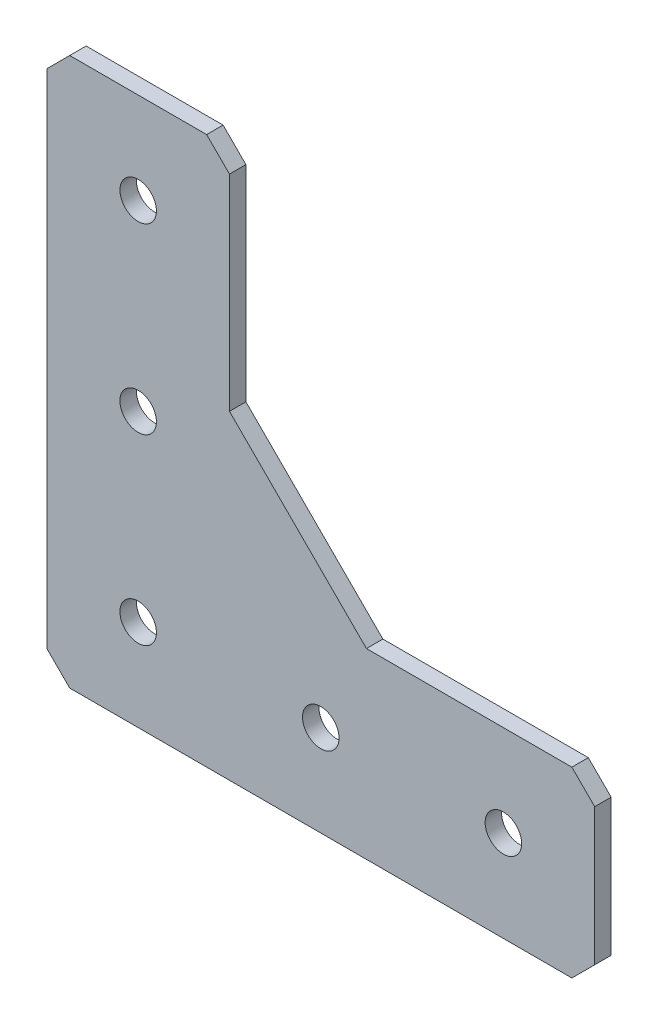
ISO-10303-21;
HEADER;
FILE_DESCRIPTION(('STEP AP214'),'2;1');
FILE_NAME('part.step','',(''),(''),'','','');
FILE_SCHEMA(('AUTOMOTIVE_DESIGN { 1 0 10303 214 1 1 1 1 }'));
ENDSEC;
DATA;
#1=APPLICATION_CONTEXT('core data for automotive mechanical design processes');
#2=APPLICATION_PROTOCOL_DEFINITION('international standard','automotive_design',2000,#1);
#3=PRODUCT_CONTEXT('',#1,'mechanical');
#4=PRODUCT('Part','Part','',(#3));
#5=PRODUCT_RELATED_PRODUCT_CATEGORY('part','',(#4));
#6=PRODUCT_DEFINITION_FORMATION('','',#4);
#7=PRODUCT_DEFINITION_CONTEXT('part definition',#1,'design');
#8=PRODUCT_DEFINITION('design','',#6,#7);
#9=PRODUCT_DEFINITION_SHAPE('','',#8);
#10=(LENGTH_UNIT() NAMED_UNIT(*) SI_UNIT(.MILLI.,.METRE.));
#11=(NAMED_UNIT(*) PLANE_ANGLE_UNIT() SI_UNIT($,.RADIAN.));
#12=(NAMED_UNIT(*) SI_UNIT($,.STERADIAN.) SOLID_ANGLE_UNIT());
#13=UNCERTAINTY_MEASURE_WITH_UNIT(LENGTH_MEASURE(1.E-05),#10,'distance_accuracy_value','');
#14=(GEOMETRIC_REPRESENTATION_CONTEXT(3) GLOBAL_UNCERTAINTY_ASSIGNED_CONTEXT((#13)) GLOBAL_UNIT_ASSIGNED_CONTEXT((#10,
#11,#12)) REPRESENTATION_CONTEXT('',''));
#15=CARTESIAN_POINT('',(0.,0.,0.));
#16=DIRECTION('',(0.,0.,1.));
#17=DIRECTION('',(1.,0.,0.));
#18=AXIS2_PLACEMENT_3D('',#15,#16,#17);
#19=CARTESIAN_POINT('',(0.,0.,0.));
#20=DIRECTION('',(0.,0.,-1.));
#21=DIRECTION('',(-1.,0.,0.));
#22=AXIS2_PLACEMENT_3D('',#19,#20,#21);
#23=PLANE('',#22);
#24=DIRECTION('',(-0.707106781186548,0.707106781186548,0.));
#25=VECTOR('',#24,1.);
#26=CARTESIAN_POINT('',(73.025,25.4,0.));
#27=LINE('',#26,#25);
#28=CARTESIAN_POINT('',(76.2,22.225,0.));
#29=VERTEX_POINT('',#28);
#30=CARTESIAN_POINT('',(73.0249999999999,25.4,0.));
#31=VERTEX_POINT('',#30);
#32=EDGE_CURVE('E402',#29,#31,#27,.T.);
#33=ORIENTED_EDGE('',*,*,#32,.F.);
#34=DIRECTION('',(0.,1.,0.));
#35=VECTOR('',#34,1.);
#36=CARTESIAN_POINT('',(76.2,22.225,0.));
#37=LINE('',#36,#35);
#38=CARTESIAN_POINT('',(76.2,3.175,0.));
#39=VERTEX_POINT('',#38);
#40=EDGE_CURVE('E398',#39,#29,#37,.T.);
#41=ORIENTED_EDGE('',*,*,#40,.F.);
#42=DIRECTION('',(0.707106781186549,0.707106781186546,0.));
#43=VECTOR('',#42,1.);
#44=CARTESIAN_POINT('',(76.2,3.175,0.));
#45=LINE('',#44,#43);
#46=CARTESIAN_POINT('',(73.025,0.,0.));
#47=VERTEX_POINT('',#46);
#48=EDGE_CURVE('E123',#47,#39,#45,.T.);
#49=ORIENTED_EDGE('',*,*,#48,.F.);
#50=DIRECTION('',(1.,0.,0.));
#51=VECTOR('',#50,1.);
#52=CARTESIAN_POINT('',(73.025,0.,0.));
#53=LINE('',#52,#51);
#54=CARTESIAN_POINT('',(3.175,0.,0.));
#55=VERTEX_POINT('',#54);
#56=EDGE_CURVE('E117',#55,#47,#53,.T.);
#57=ORIENTED_EDGE('',*,*,#56,.F.);
#58=DIRECTION('',(0.707106781186546,-0.707106781186549,0.));
#59=VECTOR('',#58,1.);
#60=CARTESIAN_POINT('',(3.175,0.,0.));
#61=LINE('',#60,#59);
#62=CARTESIAN_POINT('',(0.,3.17500000000001,0.));
#63=VERTEX_POINT('',#62);
#64=EDGE_CURVE('E108',#63,#55,#61,.T.);
#65=ORIENTED_EDGE('',*,*,#64,.F.);
#66=DIRECTION('',(0.,-1.,0.));
#67=VECTOR('',#66,1.);
#68=CARTESIAN_POINT('',(0.,3.17500000000001,0.));
#69=LINE('',#68,#67);
#70=CARTESIAN_POINT('',(0.,73.025,0.));
#71=VERTEX_POINT('',#70);
#72=EDGE_CURVE('E103',#71,#63,#69,.T.);
#73=ORIENTED_EDGE('',*,*,#72,.F.);
#74=DIRECTION('',(-0.707106781186551,-0.707106781186544,0.));
#75=VECTOR('',#74,1.);
#76=CARTESIAN_POINT('',(0.,73.025,0.));
#77=LINE('',#76,#75);
#78=CARTESIAN_POINT('',(3.17500000000003,76.2,0.));
#79=VERTEX_POINT('',#78);
#80=EDGE_CURVE('E425',#79,#71,#77,.T.);
#81=ORIENTED_EDGE('',*,*,#80,.F.);
#82=DIRECTION('',(1.,0.,0.));
#83=VECTOR('',#82,1.);
#84=CARTESIAN_POINT('',(3.17500000000003,76.2,0.));
#85=LINE('',#84,#83);
#86=CARTESIAN_POINT('',(22.225,76.2,0.));
#87=VERTEX_POINT('',#86);
#88=EDGE_CURVE('E422',#87,#79,#85,.F.);
#89=ORIENTED_EDGE('',*,*,#88,.F.);
#90=DIRECTION('',(-0.707106781186546,0.707106781186549,0.));
#91=VECTOR('',#90,1.);
#92=CARTESIAN_POINT('',(22.225,76.2,0.));
#93=LINE('',#92,#91);
#94=CARTESIAN_POINT('',(25.4,73.025,0.));
#95=VERTEX_POINT('',#94);
#96=EDGE_CURVE('E418',#95,#87,#93,.T.);
#97=ORIENTED_EDGE('',*,*,#96,.F.);
#98=DIRECTION('',(0.,1.,0.));
#99=VECTOR('',#98,1.);
#100=CARTESIAN_POINT('',(25.4,73.025,0.));
#101=LINE('',#100,#99);
#102=CARTESIAN_POINT('',(25.4,44.4500000000001,0.));
#103=VERTEX_POINT('',#102);
#104=EDGE_CURVE('E414',#103,#95,#101,.T.);
#105=ORIENTED_EDGE('',*,*,#104,.F.);
#106=DIRECTION('',(-0.707106781186544,0.707106781186551,0.));
#107=VECTOR('',#106,1.);
#108=CARTESIAN_POINT('',(25.4,44.4500000000001,0.));
#109=LINE('',#108,#107);
#110=CARTESIAN_POINT('',(44.45,25.4,0.));
#111=VERTEX_POINT('',#110);
#112=EDGE_CURVE('E410',#111,#103,#109,.T.);
#113=ORIENTED_EDGE('',*,*,#112,.F.);
#114=DIRECTION('',(-1.,0.,0.));
#115=VECTOR('',#114,1.);
#116=CARTESIAN_POINT('',(44.45,25.4,0.));
#117=LINE('',#116,#115);
#118=EDGE_CURVE('E406',#31,#111,#117,.T.);
#119=ORIENTED_EDGE('',*,*,#118,.F.);
#120=EDGE_LOOP('',(#33,#41,#49,#57,#65,#73,#81,#89,#97,#105,#113,#119));
#121=FACE_BOUND('',#120,.T.);
#122=CARTESIAN_POINT('',(12.7,12.7,0.));
#123=DIRECTION('',(0.,0.,-1.));
#124=DIRECTION('',(-1.,0.,0.));
#125=AXIS2_PLACEMENT_3D('',#122,#123,#124);
#126=CIRCLE('',#125,2.53999999999999);
#127=CARTESIAN_POINT('',(10.16,12.7,0.));
#128=VERTEX_POINT('',#127);
#129=EDGE_CURVE('E127',#128,#128,#126,.F.);
#130=ORIENTED_EDGE('',*,*,#129,.T.);
#131=EDGE_LOOP('',(#130));
#132=FACE_BOUND('',#131,.T.);
#133=CARTESIAN_POINT('',(12.7,63.5,0.));
#134=DIRECTION('',(0.,0.,-1.));
#135=DIRECTION('',(-1.,0.,0.));
#136=AXIS2_PLACEMENT_3D('',#133,#134,#135);
#137=CIRCLE('',#136,2.53999999999999);
#138=CARTESIAN_POINT('',(10.16,63.5,0.));
#139=VERTEX_POINT('',#138);
#140=EDGE_CURVE('E154',#139,#139,#137,.F.);
#141=ORIENTED_EDGE('',*,*,#140,.T.);
#142=EDGE_LOOP('',(#141));
#143=FACE_BOUND('',#142,.T.);
#144=CARTESIAN_POINT('',(12.7,38.1,0.));
#145=DIRECTION('',(0.,0.,-1.));
#146=DIRECTION('',(-1.,0.,0.));
#147=AXIS2_PLACEMENT_3D('',#144,#145,#146);
#148=CIRCLE('',#147,2.53999999999999);
#149=CARTESIAN_POINT('',(10.16,38.1,0.));
#150=VERTEX_POINT('',#149);
#151=EDGE_CURVE('E157',#150,#150,#148,.F.);
#152=ORIENTED_EDGE('',*,*,#151,.T.);
#153=EDGE_LOOP('',(#152));
#154=FACE_BOUND('',#153,.T.);
#155=CARTESIAN_POINT('',(63.5,12.7,0.));
#156=DIRECTION('',(0.,0.,-1.));
#157=DIRECTION('',(-1.,0.,0.));
#158=AXIS2_PLACEMENT_3D('',#155,#156,#157);
#159=CIRCLE('',#158,2.54);
#160=CARTESIAN_POINT('',(60.96,12.7,0.));
#161=VERTEX_POINT('',#160);
#162=EDGE_CURVE('E159',#161,#161,#159,.F.);
#163=ORIENTED_EDGE('',*,*,#162,.T.);
#164=EDGE_LOOP('',(#163));
#165=FACE_BOUND('',#164,.T.);
#166=CARTESIAN_POINT('',(38.1,12.7,0.));
#167=DIRECTION('',(0.,0.,-1.));
#168=DIRECTION('',(-1.,0.,0.));
#169=AXIS2_PLACEMENT_3D('',#166,#167,#168);
#170=CIRCLE('',#169,2.53999999999999);
#171=CARTESIAN_POINT('',(35.56,12.7,0.));
#172=VERTEX_POINT('',#171);
#173=EDGE_CURVE('E21',#172,#172,#170,.F.);
#174=ORIENTED_EDGE('',*,*,#173,.T.);
#175=EDGE_LOOP('',(#174));
#176=FACE_BOUND('',#175,.T.);
#177=ADVANCED_FACE('F18',(#121,#132,#143,#154,#165,#176),#23,.T.);
#178=CARTESIAN_POINT('',(38.1,12.7,2.286));
#179=DIRECTION('',(0.,0.,-1.));
#180=DIRECTION('',(-1.,0.,0.));
#181=AXIS2_PLACEMENT_3D('',#178,#179,#180);
#182=CYLINDRICAL_SURFACE('',#181,2.53999999999999);
#183=CARTESIAN_POINT('',(38.1,12.7,2.286));
#184=DIRECTION('',(0.,0.,-1.));
#185=DIRECTION('',(-1.,0.,0.));
#186=AXIS2_PLACEMENT_3D('',#183,#184,#185);
#187=CIRCLE('',#186,2.53999999999999);
#188=CARTESIAN_POINT('',(35.56,12.7,2.286));
#189=VERTEX_POINT('',#188);
#190=EDGE_CURVE('E148',#189,#189,#187,.F.);
#191=ORIENTED_EDGE('',*,*,#190,.T.);
#192=EDGE_LOOP('',(#191));
#193=FACE_BOUND('',#192,.T.);
#194=ORIENTED_EDGE('',*,*,#173,.F.);
#195=EDGE_LOOP('',(#194));
#196=FACE_BOUND('',#195,.T.);
#197=ADVANCED_FACE('F167',(#193,#196),#182,.F.);
#198=CARTESIAN_POINT('',(63.5,12.7,2.286));
#199=DIRECTION('',(0.,0.,-1.));
#200=DIRECTION('',(-1.,0.,0.));
#201=AXIS2_PLACEMENT_3D('',#198,#199,#200);
#202=CYLINDRICAL_SURFACE('',#201,2.54);
#203=CARTESIAN_POINT('',(63.5,12.7,2.286));
#204=DIRECTION('',(0.,0.,-1.));
#205=DIRECTION('',(-1.,0.,0.));
#206=AXIS2_PLACEMENT_3D('',#203,#204,#205);
#207=CIRCLE('',#206,2.54);
#208=CARTESIAN_POINT('',(60.96,12.7,2.286));
#209=VERTEX_POINT('',#208);
#210=EDGE_CURVE('E145',#209,#209,#207,.F.);
#211=ORIENTED_EDGE('',*,*,#210,.T.);
#212=EDGE_LOOP('',(#211));
#213=FACE_BOUND('',#212,.T.);
#214=ORIENTED_EDGE('',*,*,#162,.F.);
#215=EDGE_LOOP('',(#214));
#216=FACE_BOUND('',#215,.T.);
#217=ADVANCED_FACE('F169',(#213,#216),#202,.F.);
#218=CARTESIAN_POINT('',(12.7,38.1,2.286));
#219=DIRECTION('',(0.,0.,-1.));
#220=DIRECTION('',(-1.,0.,0.));
#221=AXIS2_PLACEMENT_3D('',#218,#219,#220);
#222=CYLINDRICAL_SURFACE('',#221,2.53999999999999);
#223=CARTESIAN_POINT('',(12.7,38.1,2.286));
#224=DIRECTION('',(0.,0.,-1.));
#225=DIRECTION('',(-1.,0.,0.));
#226=AXIS2_PLACEMENT_3D('',#223,#224,#225);
#227=CIRCLE('',#226,2.53999999999999);
#228=CARTESIAN_POINT('',(10.16,38.1,2.286));
#229=VERTEX_POINT('',#228);
#230=EDGE_CURVE('E142',#229,#229,#227,.F.);
#231=ORIENTED_EDGE('',*,*,#230,.T.);
#232=EDGE_LOOP('',(#231));
#233=FACE_BOUND('',#232,.T.);
#234=ORIENTED_EDGE('',*,*,#151,.F.);
#235=EDGE_LOOP('',(#234));
#236=FACE_BOUND('',#235,.T.);
#237=ADVANCED_FACE('F176',(#233,#236),#222,.F.);
#238=CARTESIAN_POINT('',(12.7,63.5,2.286));
#239=DIRECTION('',(0.,0.,-1.));
#240=DIRECTION('',(-1.,0.,0.));
#241=AXIS2_PLACEMENT_3D('',#238,#239,#240);
#242=CYLINDRICAL_SURFACE('',#241,2.53999999999999);
#243=CARTESIAN_POINT('',(12.7,63.5,2.286));
#244=DIRECTION('',(0.,0.,-1.));
#245=DIRECTION('',(-1.,0.,0.));
#246=AXIS2_PLACEMENT_3D('',#243,#244,#245);
#247=CIRCLE('',#246,2.53999999999999);
#248=CARTESIAN_POINT('',(10.16,63.5,2.286));
#249=VERTEX_POINT('',#248);
#250=EDGE_CURVE('E139',#249,#249,#247,.F.);
#251=ORIENTED_EDGE('',*,*,#250,.T.);
#252=EDGE_LOOP('',(#251));
#253=FACE_BOUND('',#252,.T.);
#254=ORIENTED_EDGE('',*,*,#140,.F.);
#255=EDGE_LOOP('',(#254));
#256=FACE_BOUND('',#255,.T.);
#257=ADVANCED_FACE('F233',(#253,#256),#242,.F.);
#258=CARTESIAN_POINT('',(12.7,12.7,2.286));
#259=DIRECTION('',(0.,0.,-1.));
#260=DIRECTION('',(-1.,0.,0.));
#261=AXIS2_PLACEMENT_3D('',#258,#259,#260);
#262=CYLINDRICAL_SURFACE('',#261,2.53999999999999);
#263=CARTESIAN_POINT('',(12.7,12.7,2.286));
#264=DIRECTION('',(0.,0.,-1.));
#265=DIRECTION('',(-1.,0.,0.));
#266=AXIS2_PLACEMENT_3D('',#263,#264,#265);
#267=CIRCLE('',#266,2.53999999999999);
#268=CARTESIAN_POINT('',(10.16,12.7,2.286));
#269=VERTEX_POINT('',#268);
#270=EDGE_CURVE('E136',#269,#269,#267,.F.);
#271=ORIENTED_EDGE('',*,*,#270,.T.);
#272=EDGE_LOOP('',(#271));
#273=FACE_BOUND('',#272,.T.);
#274=ORIENTED_EDGE('',*,*,#129,.F.);
#275=EDGE_LOOP('',(#274));
#276=FACE_BOUND('',#275,.T.);
#277=ADVANCED_FACE('F230',(#273,#276),#262,.F.);
#278=CARTESIAN_POINT('',(73.025,0.,2.286));
#279=DIRECTION('',(0.,-1.,0.));
#280=DIRECTION('',(1.,0.,0.));
#281=AXIS2_PLACEMENT_3D('',#278,#279,#280);
#282=PLANE('',#281);
#283=DIRECTION('',(-1.,0.,0.));
#284=VECTOR('',#283,1.);
#285=CARTESIAN_POINT('',(0.,0.,2.286));
#286=LINE('',#285,#284);
#287=CARTESIAN_POINT('',(73.025,0.,2.286));
#288=VERTEX_POINT('',#287);
#289=CARTESIAN_POINT('',(3.175,0.,2.286));
#290=VERTEX_POINT('',#289);
#291=EDGE_CURVE('E131',#288,#290,#286,.T.);
#292=ORIENTED_EDGE('',*,*,#291,.T.);
#293=DIRECTION('',(0.,0.,1.));
#294=VECTOR('',#293,1.);
#295=CARTESIAN_POINT('',(3.175,0.,2.286));
#296=LINE('',#295,#294);
#297=EDGE_CURVE('E113',#55,#290,#296,.T.);
#298=ORIENTED_EDGE('',*,*,#297,.F.);
#299=ORIENTED_EDGE('',*,*,#56,.T.);
#300=DIRECTION('',(0.,0.,1.));
#301=VECTOR('',#300,1.);
#302=CARTESIAN_POINT('',(73.025,0.,2.286));
#303=LINE('',#302,#301);
#304=EDGE_CURVE('E151',#288,#47,#303,.F.);
#305=ORIENTED_EDGE('',*,*,#304,.F.);
#306=EDGE_LOOP('',(#292,#298,#299,#305));
#307=FACE_BOUND('',#306,.T.);
#308=ADVANCED_FACE('F130',(#307),#282,.T.);
#309=CARTESIAN_POINT('',(3.175,0.,2.286));
#310=DIRECTION('',(-0.707106781186549,-0.707106781186546,0.));
#311=DIRECTION('',(0.707106781186546,-0.707106781186549,0.));
#312=AXIS2_PLACEMENT_3D('',#309,#310,#311);
#313=PLANE('',#312);
#314=DIRECTION('',(-0.707106781186546,0.707106781186549,0.));
#315=VECTOR('',#314,1.);
#316=CARTESIAN_POINT('',(3.175,0.,2.286));
#317=LINE('',#316,#315);
#318=CARTESIAN_POINT('',(0.,3.17500000000001,2.286));
#319=VERTEX_POINT('',#318);
#320=EDGE_CURVE('E384',#290,#319,#317,.T.);
#321=ORIENTED_EDGE('',*,*,#320,.T.);
#322=DIRECTION('',(0.,0.,1.));
#323=VECTOR('',#322,1.);
#324=CARTESIAN_POINT('',(0.,3.17500000000001,2.286));
#325=LINE('',#324,#323);
#326=EDGE_CURVE('E115',#63,#319,#325,.T.);
#327=ORIENTED_EDGE('',*,*,#326,.F.);
#328=ORIENTED_EDGE('',*,*,#64,.T.);
#329=ORIENTED_EDGE('',*,*,#297,.T.);
#330=EDGE_LOOP('',(#321,#327,#328,#329));
#331=FACE_BOUND('',#330,.T.);
#332=ADVANCED_FACE('F111',(#331),#313,.T.);
#333=CARTESIAN_POINT('',(0.,3.17500000000001,2.286));
#334=DIRECTION('',(-1.,0.,0.));
#335=DIRECTION('',(0.,-1.,0.));
#336=AXIS2_PLACEMENT_3D('',#333,#334,#335);
#337=PLANE('',#336);
#338=DIRECTION('',(0.,1.,0.));
#339=VECTOR('',#338,1.);
#340=CARTESIAN_POINT('',(0.,0.,2.286));
#341=LINE('',#340,#339);
#342=CARTESIAN_POINT('',(0.,73.025,2.286));
#343=VERTEX_POINT('',#342);
#344=EDGE_CURVE('E380',#319,#343,#341,.T.);
#345=ORIENTED_EDGE('',*,*,#344,.T.);
#346=DIRECTION('',(0.,0.,1.));
#347=VECTOR('',#346,1.);
#348=CARTESIAN_POINT('',(0.,73.025,2.286));
#349=LINE('',#348,#347);
#350=EDGE_CURVE('E381',#71,#343,#349,.T.);
#351=ORIENTED_EDGE('',*,*,#350,.F.);
#352=ORIENTED_EDGE('',*,*,#72,.T.);
#353=ORIENTED_EDGE('',*,*,#326,.T.);
#354=EDGE_LOOP('',(#345,#351,#352,#353));
#355=FACE_BOUND('',#354,.T.);
#356=ADVANCED_FACE('F222',(#355),#337,.T.);
#357=CARTESIAN_POINT('',(0.,73.025,2.286));
#358=DIRECTION('',(-0.707106781186544,0.707106781186551,0.));
#359=DIRECTION('',(-0.707106781186551,-0.707106781186544,0.));
#360=AXIS2_PLACEMENT_3D('',#357,#358,#359);
#361=PLANE('',#360);
#362=DIRECTION('',(0.707106781186551,0.707106781186544,0.));
#363=VECTOR('',#362,1.);
#364=CARTESIAN_POINT('',(0.,73.025,2.286));
#365=LINE('',#364,#363);
#366=CARTESIAN_POINT('',(3.17500000000003,76.2,2.286));
#367=VERTEX_POINT('',#366);
#368=EDGE_CURVE('E383',#343,#367,#365,.T.);
#369=ORIENTED_EDGE('',*,*,#368,.T.);
#370=DIRECTION('',(0.,0.,1.));
#371=VECTOR('',#370,1.);
#372=CARTESIAN_POINT('',(3.17500000000003,76.2,2.286));
#373=LINE('',#372,#371);
#374=EDGE_CURVE('E420',#79,#367,#373,.T.);
#375=ORIENTED_EDGE('',*,*,#374,.F.);
#376=ORIENTED_EDGE('',*,*,#80,.T.);
#377=ORIENTED_EDGE('',*,*,#350,.T.);
#378=EDGE_LOOP('',(#369,#375,#376,#377));
#379=FACE_BOUND('',#378,.T.);
#380=ADVANCED_FACE('F218',(#379),#361,.T.);
#381=CARTESIAN_POINT('',(3.17500000000003,76.2,2.286));
#382=DIRECTION('',(0.,1.,0.));
#383=DIRECTION('',(0.,0.,1.));
#384=AXIS2_PLACEMENT_3D('',#381,#382,#383);
#385=PLANE('',#384);
#386=DIRECTION('',(-1.,0.,0.));
#387=VECTOR('',#386,1.);
#388=CARTESIAN_POINT('',(0.,76.2,2.286));
#389=LINE('',#388,#387);
#390=CARTESIAN_POINT('',(22.225,76.2,2.286));
#391=VERTEX_POINT('',#390);
#392=EDGE_CURVE('E387',#367,#391,#389,.F.);
#393=ORIENTED_EDGE('',*,*,#392,.T.);
#394=DIRECTION('',(0.,0.,1.));
#395=VECTOR('',#394,1.);
#396=CARTESIAN_POINT('',(22.225,76.2,2.286));
#397=LINE('',#396,#395);
#398=EDGE_CURVE('E416',#87,#391,#397,.T.);
#399=ORIENTED_EDGE('',*,*,#398,.F.);
#400=ORIENTED_EDGE('',*,*,#88,.T.);
#401=ORIENTED_EDGE('',*,*,#374,.T.);
#402=EDGE_LOOP('',(#393,#399,#400,#401));
#403=FACE_BOUND('',#402,.T.);
#404=ADVANCED_FACE('F214',(#403),#385,.T.);
#405=CARTESIAN_POINT('',(22.225,76.2,2.286));
#406=DIRECTION('',(0.707106781186549,0.707106781186546,0.));
#407=DIRECTION('',(-0.707106781186546,0.707106781186549,0.));
#408=AXIS2_PLACEMENT_3D('',#405,#406,#407);
#409=PLANE('',#408);
#410=DIRECTION('',(0.707106781186546,-0.707106781186549,0.));
#411=VECTOR('',#410,1.);
#412=CARTESIAN_POINT('',(22.225,76.2,2.286));
#413=LINE('',#412,#411);
#414=CARTESIAN_POINT('',(25.4,73.025,2.286));
#415=VERTEX_POINT('',#414);
#416=EDGE_CURVE('E437',#391,#415,#413,.T.);
#417=ORIENTED_EDGE('',*,*,#416,.T.);
#418=DIRECTION('',(0.,0.,1.));
#419=VECTOR('',#418,1.);
#420=CARTESIAN_POINT('',(25.4,73.025,2.286));
#421=LINE('',#420,#419);
#422=EDGE_CURVE('E412',#95,#415,#421,.T.);
#423=ORIENTED_EDGE('',*,*,#422,.F.);
#424=ORIENTED_EDGE('',*,*,#96,.T.);
#425=ORIENTED_EDGE('',*,*,#398,.T.);
#426=EDGE_LOOP('',(#417,#423,#424,#425));
#427=FACE_BOUND('',#426,.T.);
#428=ADVANCED_FACE('F210',(#427),#409,.T.);
#429=CARTESIAN_POINT('',(25.4,73.025,2.286));
#430=DIRECTION('',(1.,0.,0.));
#431=DIRECTION('',(0.,1.,0.));
#432=AXIS2_PLACEMENT_3D('',#429,#430,#431);
#433=PLANE('',#432);
#434=DIRECTION('',(0.,1.,0.));
#435=VECTOR('',#434,1.);
#436=CARTESIAN_POINT('',(25.4,0.,2.286));
#437=LINE('',#436,#435);
#438=CARTESIAN_POINT('',(25.4,44.4500000000001,2.286));
#439=VERTEX_POINT('',#438);
#440=EDGE_CURVE('E441',#415,#439,#437,.F.);
#441=ORIENTED_EDGE('',*,*,#440,.T.);
#442=DIRECTION('',(0.,0.,1.));
#443=VECTOR('',#442,1.);
#444=CARTESIAN_POINT('',(25.4,44.4500000000001,2.286));
#445=LINE('',#444,#443);
#446=EDGE_CURVE('E408',#103,#439,#445,.T.);
#447=ORIENTED_EDGE('',*,*,#446,.F.);
#448=ORIENTED_EDGE('',*,*,#104,.T.);
#449=ORIENTED_EDGE('',*,*,#422,.T.);
#450=EDGE_LOOP('',(#441,#447,#448,#449));
#451=FACE_BOUND('',#450,.T.);
#452=ADVANCED_FACE('F206',(#451),#433,.T.);
#453=CARTESIAN_POINT('',(25.4,44.4500000000001,2.286));
#454=DIRECTION('',(0.707106781186551,0.707106781186544,0.));
#455=DIRECTION('',(-0.707106781186544,0.707106781186551,0.));
#456=AXIS2_PLACEMENT_3D('',#453,#454,#455);
#457=PLANE('',#456);
#458=DIRECTION('',(0.707106781186544,-0.707106781186551,0.));
#459=VECTOR('',#458,1.);
#460=CARTESIAN_POINT('',(25.4,44.4500000000001,2.286));
#461=LINE('',#460,#459);
#462=CARTESIAN_POINT('',(44.45,25.4,2.286));
#463=VERTEX_POINT('',#462);
#464=EDGE_CURVE('E443',#439,#463,#461,.T.);
#465=ORIENTED_EDGE('',*,*,#464,.T.);
#466=DIRECTION('',(0.,0.,1.));
#467=VECTOR('',#466,1.);
#468=CARTESIAN_POINT('',(44.45,25.4,2.286));
#469=LINE('',#468,#467);
#470=EDGE_CURVE('E404',#111,#463,#469,.T.);
#471=ORIENTED_EDGE('',*,*,#470,.F.);
#472=ORIENTED_EDGE('',*,*,#112,.T.);
#473=ORIENTED_EDGE('',*,*,#446,.T.);
#474=EDGE_LOOP('',(#465,#471,#472,#473));
#475=FACE_BOUND('',#474,.T.);
#476=ADVANCED_FACE('F202',(#475),#457,.T.);
#477=CARTESIAN_POINT('',(44.45,25.4,2.286));
#478=DIRECTION('',(0.,1.,0.));
#479=DIRECTION('',(-1.,0.,0.));
#480=AXIS2_PLACEMENT_3D('',#477,#478,#479);
#481=PLANE('',#480);
#482=DIRECTION('',(-1.,0.,0.));
#483=VECTOR('',#482,1.);
#484=CARTESIAN_POINT('',(0.,25.4,2.286));
#485=LINE('',#484,#483);
#486=CARTESIAN_POINT('',(73.0249999999999,25.4,2.286));
#487=VERTEX_POINT('',#486);
#488=EDGE_CURVE('E448',#463,#487,#485,.F.);
#489=ORIENTED_EDGE('',*,*,#488,.T.);
#490=DIRECTION('',(0.,0.,1.));
#491=VECTOR('',#490,1.);
#492=CARTESIAN_POINT('',(73.025,25.4,2.286));
#493=LINE('',#492,#491);
#494=EDGE_CURVE('E400',#31,#487,#493,.T.);
#495=ORIENTED_EDGE('',*,*,#494,.F.);
#496=ORIENTED_EDGE('',*,*,#118,.T.);
#497=ORIENTED_EDGE('',*,*,#470,.T.);
#498=EDGE_LOOP('',(#489,#495,#496,#497));
#499=FACE_BOUND('',#498,.T.);
#500=ADVANCED_FACE('F198',(#499),#481,.T.);
#501=CARTESIAN_POINT('',(73.025,25.4,2.286));
#502=DIRECTION('',(0.707106781186548,0.707106781186548,0.));
#503=DIRECTION('',(-0.707106781186548,0.707106781186548,0.));
#504=AXIS2_PLACEMENT_3D('',#501,#502,#503);
#505=PLANE('',#504);
#506=DIRECTION('',(0.707106781186548,-0.707106781186548,0.));
#507=VECTOR('',#506,1.);
#508=CARTESIAN_POINT('',(73.025,25.4,2.286));
#509=LINE('',#508,#507);
#510=CARTESIAN_POINT('',(76.2,22.225,2.286));
#511=VERTEX_POINT('',#510);
#512=EDGE_CURVE('E451',#487,#511,#509,.T.);
#513=ORIENTED_EDGE('',*,*,#512,.T.);
#514=DIRECTION('',(0.,0.,-1.));
#515=VECTOR('',#514,1.);
#516=CARTESIAN_POINT('',(76.2,22.225,2.286));
#517=LINE('',#516,#515);
#518=EDGE_CURVE('E396',#29,#511,#517,.F.);
#519=ORIENTED_EDGE('',*,*,#518,.F.);
#520=ORIENTED_EDGE('',*,*,#32,.T.);
#521=ORIENTED_EDGE('',*,*,#494,.T.);
#522=EDGE_LOOP('',(#513,#519,#520,#521));
#523=FACE_BOUND('',#522,.T.);
#524=ADVANCED_FACE('F194',(#523),#505,.T.);
#525=CARTESIAN_POINT('',(76.2,22.225,2.286));
#526=DIRECTION('',(1.,0.,0.));
#527=DIRECTION('',(0.,0.,-1.));
#528=AXIS2_PLACEMENT_3D('',#525,#526,#527);
#529=PLANE('',#528);
#530=DIRECTION('',(0.,1.,0.));
#531=VECTOR('',#530,1.);
#532=CARTESIAN_POINT('',(76.2,0.,2.286));
#533=LINE('',#532,#531);
#534=CARTESIAN_POINT('',(76.2,3.175,2.286));
#535=VERTEX_POINT('',#534);
#536=EDGE_CURVE('E27',#511,#535,#533,.F.);
#537=ORIENTED_EDGE('',*,*,#536,.T.);
#538=DIRECTION('',(0.,0.,1.));
#539=VECTOR('',#538,1.);
#540=CARTESIAN_POINT('',(76.2,3.175,2.286));
#541=LINE('',#540,#539);
#542=EDGE_CURVE('E35',#39,#535,#541,.T.);
#543=ORIENTED_EDGE('',*,*,#542,.F.);
#544=ORIENTED_EDGE('',*,*,#40,.T.);
#545=ORIENTED_EDGE('',*,*,#518,.T.);
#546=EDGE_LOOP('',(#537,#543,#544,#545));
#547=FACE_BOUND('',#546,.T.);
#548=ADVANCED_FACE('F187',(#547),#529,.T.);
#549=CARTESIAN_POINT('',(76.2,3.175,2.286));
#550=DIRECTION('',(0.707106781186546,-0.707106781186549,0.));
#551=DIRECTION('',(0.707106781186549,0.707106781186546,0.));
#552=AXIS2_PLACEMENT_3D('',#549,#550,#551);
#553=PLANE('',#552);
#554=DIRECTION('',(-0.707106781186549,-0.707106781186546,0.));
#555=VECTOR('',#554,1.);
#556=CARTESIAN_POINT('',(76.2,3.175,2.286));
#557=LINE('',#556,#555);
#558=EDGE_CURVE('E11',#535,#288,#557,.T.);
#559=ORIENTED_EDGE('',*,*,#558,.T.);
#560=ORIENTED_EDGE('',*,*,#304,.T.);
#561=ORIENTED_EDGE('',*,*,#48,.T.);
#562=ORIENTED_EDGE('',*,*,#542,.T.);
#563=EDGE_LOOP('',(#559,#560,#561,#562));
#564=FACE_BOUND('',#563,.T.);
#565=ADVANCED_FACE('F181',(#564),#553,.T.);
#566=CARTESIAN_POINT('',(0.,0.,2.286));
#567=DIRECTION('',(0.,0.,-1.));
#568=DIRECTION('',(-1.,0.,0.));
#569=AXIS2_PLACEMENT_3D('',#566,#567,#568);
#570=PLANE('',#569);
#571=ORIENTED_EDGE('',*,*,#536,.F.);
#572=ORIENTED_EDGE('',*,*,#512,.F.);
#573=ORIENTED_EDGE('',*,*,#488,.F.);
#574=ORIENTED_EDGE('',*,*,#464,.F.);
#575=ORIENTED_EDGE('',*,*,#440,.F.);
#576=ORIENTED_EDGE('',*,*,#416,.F.);
#577=ORIENTED_EDGE('',*,*,#392,.F.);
#578=ORIENTED_EDGE('',*,*,#368,.F.);
#579=ORIENTED_EDGE('',*,*,#344,.F.);
#580=ORIENTED_EDGE('',*,*,#320,.F.);
#581=ORIENTED_EDGE('',*,*,#291,.F.);
#582=ORIENTED_EDGE('',*,*,#558,.F.);
#583=EDGE_LOOP('',(#571,#572,#573,#574,#575,#576,#577,#578,#579,#580,#581,#582));
#584=FACE_BOUND('',#583,.T.);
#585=ORIENTED_EDGE('',*,*,#270,.F.);
#586=EDGE_LOOP('',(#585));
#587=FACE_BOUND('',#586,.T.);
#588=ORIENTED_EDGE('',*,*,#250,.F.);
#589=EDGE_LOOP('',(#588));
#590=FACE_BOUND('',#589,.T.);
#591=ORIENTED_EDGE('',*,*,#230,.F.);
#592=EDGE_LOOP('',(#591));
#593=FACE_BOUND('',#592,.T.);
#594=ORIENTED_EDGE('',*,*,#210,.F.);
#595=EDGE_LOOP('',(#594));
#596=FACE_BOUND('',#595,.T.);
#597=ORIENTED_EDGE('',*,*,#190,.F.);
#598=EDGE_LOOP('',(#597));
#599=FACE_BOUND('',#598,.T.);
#600=ADVANCED_FACE('F179',(#584,#587,#590,#593,#596,#599),#570,.F.);
#601=CLOSED_SHELL('',(#177,#197,#217,#237,#257,#277,#308,#332,#356,#380,#404,#428,#452,#476,
#500,#524,#548,#565,#600));
#602=MANIFOLD_SOLID_BREP('B1',#601);
#603=ADVANCED_BREP_SHAPE_REPRESENTATION('',(#18,#602),#14);
#604=SHAPE_DEFINITION_REPRESENTATION(#9,#603);
ENDSEC;
END-ISO-10303-21;
